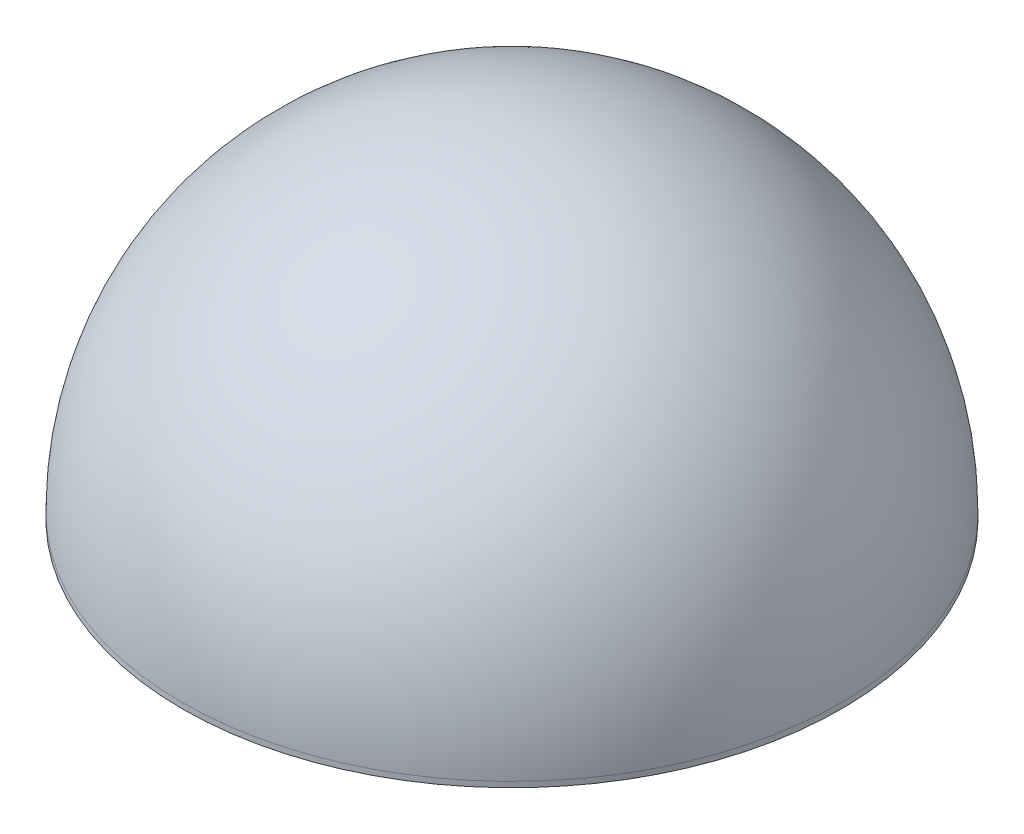
ISO-10303-21;
HEADER;
FILE_DESCRIPTION(('STEP AP214'),'2;1');
FILE_NAME('part.step','',(''),(''),'','','');
FILE_SCHEMA(('AUTOMOTIVE_DESIGN { 1 0 10303 214 1 1 1 1 }'));
ENDSEC;
DATA;
#1=APPLICATION_CONTEXT('core data for automotive mechanical design processes');
#2=APPLICATION_PROTOCOL_DEFINITION('international standard','automotive_design',2000,#1);
#3=PRODUCT_CONTEXT('',#1,'mechanical');
#4=PRODUCT('Part','Part','',(#3));
#5=PRODUCT_RELATED_PRODUCT_CATEGORY('part','',(#4));
#6=PRODUCT_DEFINITION_FORMATION('','',#4);
#7=PRODUCT_DEFINITION_CONTEXT('part definition',#1,'design');
#8=PRODUCT_DEFINITION('design','',#6,#7);
#9=PRODUCT_DEFINITION_SHAPE('','',#8);
#10=(LENGTH_UNIT() NAMED_UNIT(*) SI_UNIT(.MILLI.,.METRE.));
#11=(NAMED_UNIT(*) PLANE_ANGLE_UNIT() SI_UNIT($,.RADIAN.));
#12=(NAMED_UNIT(*) SI_UNIT($,.STERADIAN.) SOLID_ANGLE_UNIT());
#13=UNCERTAINTY_MEASURE_WITH_UNIT(LENGTH_MEASURE(1.E-05),#10,'distance_accuracy_value','');
#14=(GEOMETRIC_REPRESENTATION_CONTEXT(3) GLOBAL_UNCERTAINTY_ASSIGNED_CONTEXT((#13)) GLOBAL_UNIT_ASSIGNED_CONTEXT((#10,
#11,#12)) REPRESENTATION_CONTEXT('',''));
#15=CARTESIAN_POINT('',(0.,0.,0.));
#16=DIRECTION('',(0.,0.,1.));
#17=DIRECTION('',(1.,0.,0.));
#18=AXIS2_PLACEMENT_3D('',#15,#16,#17);
#19=CARTESIAN_POINT('',(0.,2.54,0.));
#20=DIRECTION('',(0.,-1.,0.));
#21=DIRECTION('',(0.,0.,-1.));
#22=AXIS2_PLACEMENT_3D('',#19,#20,#21);
#23=CYLINDRICAL_SURFACE('',#22,152.4);
#24=CARTESIAN_POINT('',(0.,2.54,0.));
#25=DIRECTION('',(0.,1.,0.));
#26=DIRECTION('',(0.,0.,1.));
#27=AXIS2_PLACEMENT_3D('',#24,#25,#26);
#28=CIRCLE('',#27,152.4);
#29=CARTESIAN_POINT('',(0.,2.54,152.4));
#30=VERTEX_POINT('',#29);
#31=EDGE_CURVE('E10',#30,#30,#28,.T.);
#32=ORIENTED_EDGE('',*,*,#31,.F.);
#33=EDGE_LOOP('',(#32));
#34=FACE_BOUND('',#33,.T.);
#35=CARTESIAN_POINT('',(0.,0.,0.));
#36=DIRECTION('',(0.,1.,0.));
#37=DIRECTION('',(0.,0.,1.));
#38=AXIS2_PLACEMENT_3D('',#35,#36,#37);
#39=CIRCLE('',#38,152.4);
#40=CARTESIAN_POINT('',(0.,0.,152.4));
#41=VERTEX_POINT('',#40);
#42=EDGE_CURVE('E38',#41,#41,#39,.T.);
#43=ORIENTED_EDGE('',*,*,#42,.T.);
#44=EDGE_LOOP('',(#43));
#45=FACE_BOUND('',#44,.T.);
#46=ADVANCED_FACE('F31',(#34,#45),#23,.T.);
#47=CARTESIAN_POINT('',(0.,2.54,0.));
#48=DIRECTION('',(0.,0.,1.));
#49=DIRECTION('',(1.,0.,0.));
#50=AXIS2_PLACEMENT_3D('',#47,#48,#49);
#51=SPHERICAL_SURFACE('',#50,152.4);
#52=CARTESIAN_POINT('',(0.,2.54,0.));
#53=DIRECTION('',(0.,1.,0.));
#54=DIRECTION('',(0.,0.,1.));
#55=AXIS2_PLACEMENT_3D('',#52,#53,#54);
#56=SPHERICAL_SURFACE('',#55,152.4);
#57=ORIENTED_EDGE('',*,*,#31,.T.);
#58=EDGE_LOOP('',(#57));
#59=FACE_BOUND('',#58,.T.);
#60=ADVANCED_FACE('F33',(#59),#56,.T.);
#61=CARTESIAN_POINT('',(0.,0.,0.));
#62=DIRECTION('',(0.,1.,0.));
#63=DIRECTION('',(0.,0.,1.));
#64=AXIS2_PLACEMENT_3D('',#61,#62,#63);
#65=PLANE('',#64);
#66=ORIENTED_EDGE('',*,*,#42,.F.);
#67=EDGE_LOOP('',(#66));
#68=FACE_BOUND('',#67,.T.);
#69=ADVANCED_FACE('F45',(#68),#65,.F.);
#70=CLOSED_SHELL('',(#46,#60,#69));
#71=MANIFOLD_SOLID_BREP('B2',#70);
#72=ADVANCED_BREP_SHAPE_REPRESENTATION('',(#18,#71),#14);
#73=SHAPE_DEFINITION_REPRESENTATION(#9,#72);
ENDSEC;
END-ISO-10303-21;
